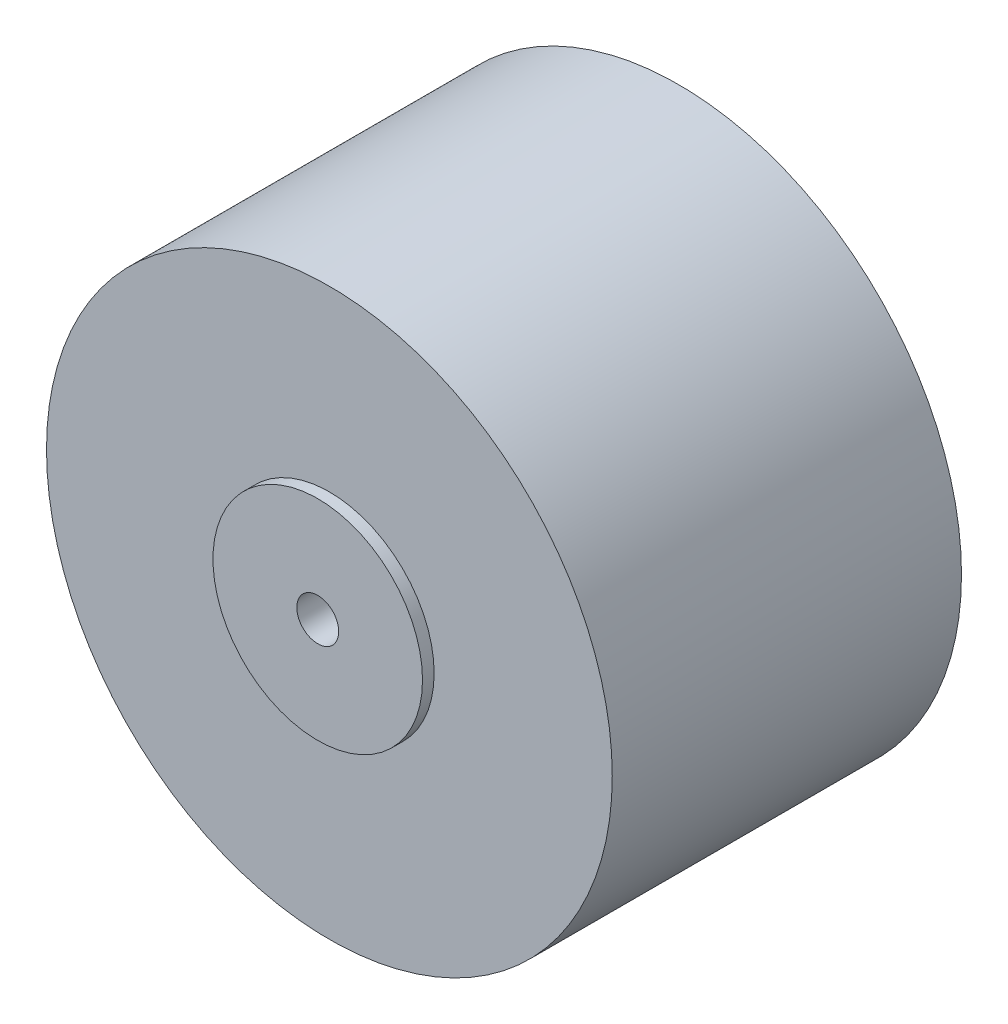
ISO-10303-21;
HEADER;
FILE_DESCRIPTION(('STEP AP214'),'2;1');
FILE_NAME('part.step','',(''),(''),'','','');
FILE_SCHEMA(('AUTOMOTIVE_DESIGN { 1 0 10303 214 1 1 1 1 }'));
ENDSEC;
DATA;
#1=APPLICATION_CONTEXT('core data for automotive mechanical design processes');
#2=APPLICATION_PROTOCOL_DEFINITION('international standard','automotive_design',2000,#1);
#3=PRODUCT_CONTEXT('',#1,'mechanical');
#4=PRODUCT('Part','Part','',(#3));
#5=PRODUCT_RELATED_PRODUCT_CATEGORY('part','',(#4));
#6=PRODUCT_DEFINITION_FORMATION('','',#4);
#7=PRODUCT_DEFINITION_CONTEXT('part definition',#1,'design');
#8=PRODUCT_DEFINITION('design','',#6,#7);
#9=PRODUCT_DEFINITION_SHAPE('','',#8);
#10=(LENGTH_UNIT() NAMED_UNIT(*) SI_UNIT(.MILLI.,.METRE.));
#11=(NAMED_UNIT(*) PLANE_ANGLE_UNIT() SI_UNIT($,.RADIAN.));
#12=(NAMED_UNIT(*) SI_UNIT($,.STERADIAN.) SOLID_ANGLE_UNIT());
#13=UNCERTAINTY_MEASURE_WITH_UNIT(LENGTH_MEASURE(1.E-05),#10,'distance_accuracy_value','');
#14=(GEOMETRIC_REPRESENTATION_CONTEXT(3) GLOBAL_UNCERTAINTY_ASSIGNED_CONTEXT((#13)) GLOBAL_UNIT_ASSIGNED_CONTEXT((#10,
#11,#12)) REPRESENTATION_CONTEXT('',''));
#15=CARTESIAN_POINT('',(0.,0.,0.));
#16=DIRECTION('',(0.,0.,1.));
#17=DIRECTION('',(1.,0.,0.));
#18=AXIS2_PLACEMENT_3D('',#15,#16,#17);
#19=CARTESIAN_POINT('',(0.,0.,0.));
#20=DIRECTION('',(0.,0.,1.));
#21=DIRECTION('',(1.,0.,0.));
#22=AXIS2_PLACEMENT_3D('',#19,#20,#21);
#23=PLANE('',#22);
#24=CARTESIAN_POINT('',(0.,0.,0.));
#25=DIRECTION('',(0.,0.,1.));
#26=DIRECTION('',(1.,0.,0.));
#27=AXIS2_PLACEMENT_3D('',#24,#25,#26);
#28=CIRCLE('',#27,12.15);
#29=CARTESIAN_POINT('',(12.15,0.,0.));
#30=VERTEX_POINT('',#29);
#31=EDGE_CURVE('E39',#30,#30,#28,.T.);
#32=ORIENTED_EDGE('',*,*,#31,.F.);
#33=EDGE_LOOP('',(#32));
#34=FACE_BOUND('',#33,.T.);
#35=CARTESIAN_POINT('',(0.,0.,0.));
#36=DIRECTION('',(0.,0.,1.));
#37=DIRECTION('',(1.,0.,0.));
#38=AXIS2_PLACEMENT_3D('',#35,#36,#37);
#39=CIRCLE('',#38,0.9);
#40=CARTESIAN_POINT('',(0.9,0.,0.));
#41=VERTEX_POINT('',#40);
#42=EDGE_CURVE('E51',#41,#41,#39,.F.);
#43=ORIENTED_EDGE('',*,*,#42,.F.);
#44=EDGE_LOOP('',(#43));
#45=FACE_BOUND('',#44,.T.);
#46=ADVANCED_FACE('F31',(#34,#45),#23,.F.);
#47=CARTESIAN_POINT('',(0.,0.,15.5));
#48=DIRECTION('',(0.,0.,1.));
#49=DIRECTION('',(1.,0.,0.));
#50=AXIS2_PLACEMENT_3D('',#47,#48,#49);
#51=PLANE('',#50);
#52=CARTESIAN_POINT('',(0.,0.,15.5));
#53=DIRECTION('',(0.,0.,1.));
#54=DIRECTION('',(1.,0.,0.));
#55=AXIS2_PLACEMENT_3D('',#52,#53,#54);
#56=CIRCLE('',#55,4.5);
#57=CARTESIAN_POINT('',(4.5,0.,15.5));
#58=VERTEX_POINT('',#57);
#59=EDGE_CURVE('E48',#58,#58,#56,.T.);
#60=ORIENTED_EDGE('',*,*,#59,.T.);
#61=EDGE_LOOP('',(#60));
#62=FACE_BOUND('',#61,.T.);
#63=CARTESIAN_POINT('',(0.,0.,15.5));
#64=DIRECTION('',(0.,0.,1.));
#65=DIRECTION('',(1.,0.,0.));
#66=AXIS2_PLACEMENT_3D('',#63,#64,#65);
#67=CIRCLE('',#66,0.9);
#68=CARTESIAN_POINT('',(0.9,0.,15.5));
#69=VERTEX_POINT('',#68);
#70=EDGE_CURVE('E35',#69,#69,#67,.F.);
#71=ORIENTED_EDGE('',*,*,#70,.T.);
#72=EDGE_LOOP('',(#71));
#73=FACE_BOUND('',#72,.T.);
#74=ADVANCED_FACE('F58',(#62,#73),#51,.T.);
#75=CARTESIAN_POINT('',(0.,0.,15.));
#76=DIRECTION('',(0.,0.,1.));
#77=DIRECTION('',(1.,0.,0.));
#78=AXIS2_PLACEMENT_3D('',#75,#76,#77);
#79=PLANE('',#78);
#80=CARTESIAN_POINT('',(0.,0.,15.));
#81=DIRECTION('',(0.,0.,1.));
#82=DIRECTION('',(1.,0.,0.));
#83=AXIS2_PLACEMENT_3D('',#80,#81,#82);
#84=CIRCLE('',#83,12.15);
#85=CARTESIAN_POINT('',(12.15,0.,15.));
#86=VERTEX_POINT('',#85);
#87=EDGE_CURVE('E10',#86,#86,#84,.T.);
#88=ORIENTED_EDGE('',*,*,#87,.T.);
#89=EDGE_LOOP('',(#88));
#90=FACE_BOUND('',#89,.T.);
#91=CARTESIAN_POINT('',(0.,0.,15.));
#92=DIRECTION('',(0.,0.,1.));
#93=DIRECTION('',(1.,0.,0.));
#94=AXIS2_PLACEMENT_3D('',#91,#92,#93);
#95=CIRCLE('',#94,4.5);
#96=CARTESIAN_POINT('',(4.5,0.,15.));
#97=VERTEX_POINT('',#96);
#98=EDGE_CURVE('E44',#97,#97,#95,.F.);
#99=ORIENTED_EDGE('',*,*,#98,.T.);
#100=EDGE_LOOP('',(#99));
#101=FACE_BOUND('',#100,.T.);
#102=ADVANCED_FACE('F75',(#90,#101),#79,.T.);
#103=CARTESIAN_POINT('',(0.,0.,15.));
#104=DIRECTION('',(0.,0.,-1.));
#105=DIRECTION('',(-1.,0.,0.));
#106=AXIS2_PLACEMENT_3D('',#103,#104,#105);
#107=CYLINDRICAL_SURFACE('',#106,12.15);
#108=ORIENTED_EDGE('',*,*,#87,.F.);
#109=EDGE_LOOP('',(#108));
#110=FACE_BOUND('',#109,.T.);
#111=ORIENTED_EDGE('',*,*,#31,.T.);
#112=EDGE_LOOP('',(#111));
#113=FACE_BOUND('',#112,.T.);
#114=ADVANCED_FACE('F33',(#110,#113),#107,.T.);
#115=CARTESIAN_POINT('',(0.,0.,15.5));
#116=DIRECTION('',(0.,0.,-1.));
#117=DIRECTION('',(-1.,0.,0.));
#118=AXIS2_PLACEMENT_3D('',#115,#116,#117);
#119=CYLINDRICAL_SURFACE('',#118,4.5);
#120=ORIENTED_EDGE('',*,*,#98,.F.);
#121=EDGE_LOOP('',(#120));
#122=FACE_BOUND('',#121,.T.);
#123=ORIENTED_EDGE('',*,*,#59,.F.);
#124=EDGE_LOOP('',(#123));
#125=FACE_BOUND('',#124,.T.);
#126=ADVANCED_FACE('F62',(#122,#125),#119,.T.);
#127=CARTESIAN_POINT('',(0.,0.,19.5));
#128=DIRECTION('',(0.,0.,-1.));
#129=DIRECTION('',(-1.,0.,0.));
#130=AXIS2_PLACEMENT_3D('',#127,#128,#129);
#131=CYLINDRICAL_SURFACE('',#130,0.9);
#132=ORIENTED_EDGE('',*,*,#70,.F.);
#133=EDGE_LOOP('',(#132));
#134=FACE_BOUND('',#133,.T.);
#135=ORIENTED_EDGE('',*,*,#42,.T.);
#136=EDGE_LOOP('',(#135));
#137=FACE_BOUND('',#136,.T.);
#138=ADVANCED_FACE('F60',(#134,#137),#131,.F.);
#139=CLOSED_SHELL('',(#46,#74,#102,#114,#126,#138));
#140=MANIFOLD_SOLID_BREP('B2',#139);
#141=ADVANCED_BREP_SHAPE_REPRESENTATION('',(#18,#140),#14);
#142=SHAPE_DEFINITION_REPRESENTATION(#9,#141);
ENDSEC;
END-ISO-10303-21;
